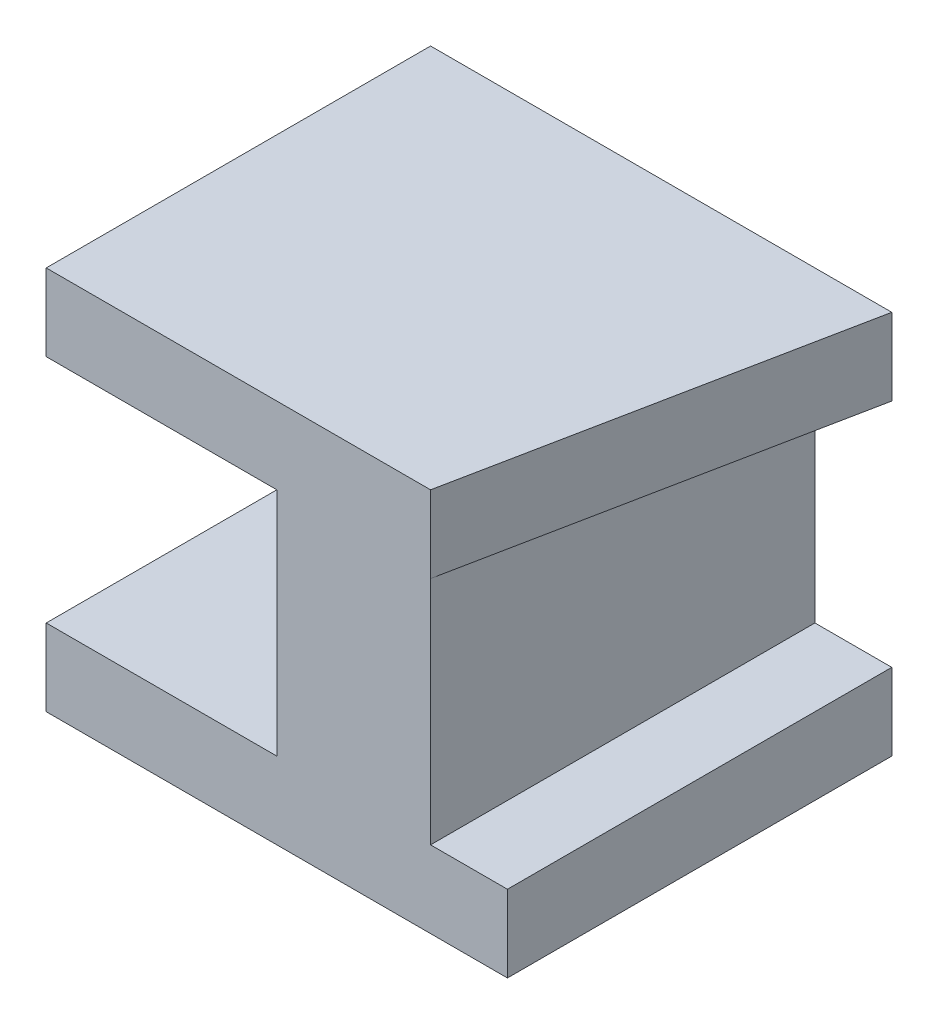
ISO-10303-21;
HEADER;
FILE_DESCRIPTION(('STEP AP214'),'2;1');
FILE_NAME('part.step','',(''),(''),'','','');
FILE_SCHEMA(('AUTOMOTIVE_DESIGN { 1 0 10303 214 1 1 1 1 }'));
ENDSEC;
DATA;
#1=APPLICATION_CONTEXT('core data for automotive mechanical design processes');
#2=APPLICATION_PROTOCOL_DEFINITION('international standard','automotive_design',2000,#1);
#3=PRODUCT_CONTEXT('',#1,'mechanical');
#4=PRODUCT('Part','Part','',(#3));
#5=PRODUCT_RELATED_PRODUCT_CATEGORY('part','',(#4));
#6=PRODUCT_DEFINITION_FORMATION('','',#4);
#7=PRODUCT_DEFINITION_CONTEXT('part definition',#1,'design');
#8=PRODUCT_DEFINITION('design','',#6,#7);
#9=PRODUCT_DEFINITION_SHAPE('','',#8);
#10=(LENGTH_UNIT() NAMED_UNIT(*) SI_UNIT(.MILLI.,.METRE.));
#11=(NAMED_UNIT(*) PLANE_ANGLE_UNIT() SI_UNIT($,.RADIAN.));
#12=(NAMED_UNIT(*) SI_UNIT($,.STERADIAN.) SOLID_ANGLE_UNIT());
#13=UNCERTAINTY_MEASURE_WITH_UNIT(LENGTH_MEASURE(1.E-05),#10,'distance_accuracy_value','');
#14=(GEOMETRIC_REPRESENTATION_CONTEXT(3) GLOBAL_UNCERTAINTY_ASSIGNED_CONTEXT((#13)) GLOBAL_UNIT_ASSIGNED_CONTEXT((#10,
#11,#12)) REPRESENTATION_CONTEXT('',''));
#15=CARTESIAN_POINT('',(0.,0.,0.));
#16=DIRECTION('',(0.,0.,1.));
#17=DIRECTION('',(1.,0.,0.));
#18=AXIS2_PLACEMENT_3D('',#15,#16,#17);
#19=CARTESIAN_POINT('',(25.,0.,25.));
#20=DIRECTION('',(-1.,0.,0.));
#21=DIRECTION('',(0.,0.,1.));
#22=AXIS2_PLACEMENT_3D('',#19,#20,#21);
#23=PLANE('',#22);
#24=DIRECTION('',(0.,0.,1.));
#25=VECTOR('',#24,1.);
#26=CARTESIAN_POINT('',(25.,5.,25.));
#27=LINE('',#26,#25);
#28=CARTESIAN_POINT('',(25.,5.,0.));
#29=VERTEX_POINT('',#28);
#30=CARTESIAN_POINT('',(25.,5.,25.));
#31=VERTEX_POINT('',#30);
#32=EDGE_CURVE('E141',#29,#31,#27,.T.);
#33=ORIENTED_EDGE('',*,*,#32,.F.);
#34=DIRECTION('',(0.,1.,0.));
#35=VECTOR('',#34,1.);
#36=CARTESIAN_POINT('',(25.,0.,0.));
#37=LINE('',#36,#35);
#38=CARTESIAN_POINT('',(25.,20.,0.));
#39=VERTEX_POINT('',#38);
#40=EDGE_CURVE('E159',#29,#39,#37,.T.);
#41=ORIENTED_EDGE('',*,*,#40,.T.);
#42=DIRECTION('',(0.,0.,-1.));
#43=VECTOR('',#42,1.);
#44=CARTESIAN_POINT('',(25.,20.,25.));
#45=LINE('',#44,#43);
#46=CARTESIAN_POINT('',(25.,20.,25.));
#47=VERTEX_POINT('',#46);
#48=EDGE_CURVE('E146',#47,#39,#45,.T.);
#49=ORIENTED_EDGE('',*,*,#48,.F.);
#50=DIRECTION('',(0.,1.,0.));
#51=VECTOR('',#50,1.);
#52=CARTESIAN_POINT('',(25.,0.,25.));
#53=LINE('',#52,#51);
#54=EDGE_CURVE('E48',#31,#47,#53,.T.);
#55=ORIENTED_EDGE('',*,*,#54,.F.);
#56=EDGE_LOOP('',(#33,#41,#49,#55));
#57=FACE_BOUND('',#56,.T.);
#58=ADVANCED_FACE('F33',(#57),#23,.F.);
#59=CARTESIAN_POINT('',(0.,20.,25.));
#60=DIRECTION('',(0.,1.,0.));
#61=DIRECTION('',(0.,0.,1.));
#62=AXIS2_PLACEMENT_3D('',#59,#60,#61);
#63=PLANE('',#62);
#64=DIRECTION('',(1.,0.,0.));
#65=VECTOR('',#64,1.);
#66=CARTESIAN_POINT('',(5.,20.,10.));
#67=LINE('',#66,#65);
#68=CARTESIAN_POINT('',(5.,20.,10.));
#69=VERTEX_POINT('',#68);
#70=CARTESIAN_POINT('',(15.,20.,10.));
#71=VERTEX_POINT('',#70);
#72=EDGE_CURVE('E178',#69,#71,#67,.T.);
#73=ORIENTED_EDGE('',*,*,#72,.T.);
#74=DIRECTION('',(0.,0.,-1.));
#75=VECTOR('',#74,1.);
#76=CARTESIAN_POINT('',(15.,20.,25.));
#77=LINE('',#76,#75);
#78=CARTESIAN_POINT('',(15.,20.,25.));
#79=VERTEX_POINT('',#78);
#80=EDGE_CURVE('E218',#79,#71,#77,.T.);
#81=ORIENTED_EDGE('',*,*,#80,.F.);
#82=DIRECTION('',(1.,0.,0.));
#83=VECTOR('',#82,1.);
#84=CARTESIAN_POINT('',(0.,20.,25.));
#85=LINE('',#84,#83);
#86=CARTESIAN_POINT('',(0.,20.,25.));
#87=VERTEX_POINT('',#86);
#88=EDGE_CURVE('E194',#87,#79,#85,.T.);
#89=ORIENTED_EDGE('',*,*,#88,.F.);
#90=DIRECTION('',(0.,0.,-1.));
#91=VECTOR('',#90,1.);
#92=CARTESIAN_POINT('',(0.,20.,25.));
#93=LINE('',#92,#91);
#94=CARTESIAN_POINT('',(0.,20.,0.));
#95=VERTEX_POINT('',#94);
#96=EDGE_CURVE('E221',#87,#95,#93,.T.);
#97=ORIENTED_EDGE('',*,*,#96,.T.);
#98=DIRECTION('',(1.,0.,0.));
#99=VECTOR('',#98,1.);
#100=CARTESIAN_POINT('',(0.,20.,0.));
#101=LINE('',#100,#99);
#102=CARTESIAN_POINT('',(5.,20.,0.));
#103=VERTEX_POINT('',#102);
#104=EDGE_CURVE('E210',#95,#103,#101,.T.);
#105=ORIENTED_EDGE('',*,*,#104,.T.);
#106=DIRECTION('',(0.,0.,-1.));
#107=VECTOR('',#106,1.);
#108=CARTESIAN_POINT('',(5.,20.,0.));
#109=LINE('',#108,#107);
#110=EDGE_CURVE('E56',#69,#103,#109,.T.);
#111=ORIENTED_EDGE('',*,*,#110,.F.);
#112=EDGE_LOOP('',(#73,#81,#89,#97,#105,#111));
#113=FACE_BOUND('',#112,.T.);
#114=ADVANCED_FACE('F237',(#113),#63,.F.);
#115=CARTESIAN_POINT('',(15.,20.,25.));
#116=DIRECTION('',(1.,0.,0.));
#117=DIRECTION('',(0.,0.,-1.));
#118=AXIS2_PLACEMENT_3D('',#115,#116,#117);
#119=PLANE('',#118);
#120=DIRECTION('',(0.,1.,0.));
#121=VECTOR('',#120,1.);
#122=CARTESIAN_POINT('',(15.,5.,10.));
#123=LINE('',#122,#121);
#124=CARTESIAN_POINT('',(15.,5.,10.));
#125=VERTEX_POINT('',#124);
#126=EDGE_CURVE('E168',#125,#71,#123,.T.);
#127=ORIENTED_EDGE('',*,*,#126,.F.);
#128=DIRECTION('',(0.,0.,-1.));
#129=VECTOR('',#128,1.);
#130=CARTESIAN_POINT('',(15.,5.,25.));
#131=LINE('',#130,#129);
#132=CARTESIAN_POINT('',(15.,5.,25.));
#133=VERTEX_POINT('',#132);
#134=EDGE_CURVE('E215',#133,#125,#131,.T.);
#135=ORIENTED_EDGE('',*,*,#134,.F.);
#136=DIRECTION('',(0.,-1.,0.));
#137=VECTOR('',#136,1.);
#138=CARTESIAN_POINT('',(15.,20.,25.));
#139=LINE('',#138,#137);
#140=EDGE_CURVE('E196',#79,#133,#139,.T.);
#141=ORIENTED_EDGE('',*,*,#140,.F.);
#142=ORIENTED_EDGE('',*,*,#80,.T.);
#143=EDGE_LOOP('',(#127,#135,#141,#142));
#144=FACE_BOUND('',#143,.T.);
#145=ADVANCED_FACE('F248',(#144),#119,.F.);
#146=CARTESIAN_POINT('',(15.,5.,25.));
#147=DIRECTION('',(0.,-1.,0.));
#148=DIRECTION('',(1.,0.,0.));
#149=AXIS2_PLACEMENT_3D('',#146,#147,#148);
#150=PLANE('',#149);
#151=DIRECTION('',(1.,0.,0.));
#152=VECTOR('',#151,1.);
#153=CARTESIAN_POINT('',(5.,5.,10.));
#154=LINE('',#153,#152);
#155=CARTESIAN_POINT('',(5.,5.,10.));
#156=VERTEX_POINT('',#155);
#157=EDGE_CURVE('E182',#156,#125,#154,.T.);
#158=ORIENTED_EDGE('',*,*,#157,.F.);
#159=DIRECTION('',(0.,0.,1.));
#160=VECTOR('',#159,1.);
#161=CARTESIAN_POINT('',(5.,5.,0.));
#162=LINE('',#161,#160);
#163=CARTESIAN_POINT('',(5.,5.,0.));
#164=VERTEX_POINT('',#163);
#165=EDGE_CURVE('E172',#164,#156,#162,.T.);
#166=ORIENTED_EDGE('',*,*,#165,.F.);
#167=DIRECTION('',(-1.,0.,0.));
#168=VECTOR('',#167,1.);
#169=CARTESIAN_POINT('',(15.,5.,0.));
#170=LINE('',#169,#168);
#171=CARTESIAN_POINT('',(0.,5.,0.));
#172=VERTEX_POINT('',#171);
#173=EDGE_CURVE('E189',#164,#172,#170,.T.);
#174=ORIENTED_EDGE('',*,*,#173,.T.);
#175=DIRECTION('',(0.,0.,-1.));
#176=VECTOR('',#175,1.);
#177=CARTESIAN_POINT('',(0.,5.,25.));
#178=LINE('',#177,#176);
#179=CARTESIAN_POINT('',(0.,5.,25.));
#180=VERTEX_POINT('',#179);
#181=EDGE_CURVE('E200',#180,#172,#178,.T.);
#182=ORIENTED_EDGE('',*,*,#181,.F.);
#183=DIRECTION('',(-1.,0.,0.));
#184=VECTOR('',#183,1.);
#185=CARTESIAN_POINT('',(15.,5.,25.));
#186=LINE('',#185,#184);
#187=EDGE_CURVE('E198',#133,#180,#186,.T.);
#188=ORIENTED_EDGE('',*,*,#187,.F.);
#189=ORIENTED_EDGE('',*,*,#134,.T.);
#190=EDGE_LOOP('',(#158,#166,#174,#182,#188,#189));
#191=FACE_BOUND('',#190,.T.);
#192=ADVANCED_FACE('F281',(#191),#150,.F.);
#193=CARTESIAN_POINT('',(0.,5.,25.));
#194=DIRECTION('',(1.,0.,0.));
#195=DIRECTION('',(0.,1.,0.));
#196=AXIS2_PLACEMENT_3D('',#193,#194,#195);
#197=PLANE('',#196);
#198=DIRECTION('',(0.,-1.,0.));
#199=VECTOR('',#198,1.);
#200=CARTESIAN_POINT('',(0.,5.,0.));
#201=LINE('',#200,#199);
#202=CARTESIAN_POINT('',(0.,0.,0.));
#203=VERTEX_POINT('',#202);
#204=EDGE_CURVE('E185',#172,#203,#201,.T.);
#205=ORIENTED_EDGE('',*,*,#204,.T.);
#206=DIRECTION('',(0.,0.,-1.));
#207=VECTOR('',#206,1.);
#208=CARTESIAN_POINT('',(0.,0.,25.));
#209=LINE('',#208,#207);
#210=CARTESIAN_POINT('',(0.,0.,25.));
#211=VERTEX_POINT('',#210);
#212=EDGE_CURVE('E11',#211,#203,#209,.T.);
#213=ORIENTED_EDGE('',*,*,#212,.F.);
#214=DIRECTION('',(0.,-1.,0.));
#215=VECTOR('',#214,1.);
#216=CARTESIAN_POINT('',(0.,5.,25.));
#217=LINE('',#216,#215);
#218=EDGE_CURVE('E186',#180,#211,#217,.T.);
#219=ORIENTED_EDGE('',*,*,#218,.F.);
#220=ORIENTED_EDGE('',*,*,#181,.T.);
#221=EDGE_LOOP('',(#205,#213,#219,#220));
#222=FACE_BOUND('',#221,.T.);
#223=ADVANCED_FACE('F35',(#222),#197,.F.);
#224=CARTESIAN_POINT('',(0.,0.,25.));
#225=DIRECTION('',(0.,1.,0.));
#226=DIRECTION('',(0.,0.,1.));
#227=AXIS2_PLACEMENT_3D('',#224,#225,#226);
#228=PLANE('',#227);
#229=DIRECTION('',(1.,0.,0.));
#230=VECTOR('',#229,1.);
#231=CARTESIAN_POINT('',(0.,0.,0.));
#232=LINE('',#231,#230);
#233=CARTESIAN_POINT('',(30.,0.,0.));
#234=VERTEX_POINT('',#233);
#235=EDGE_CURVE('E203',#203,#234,#232,.T.);
#236=ORIENTED_EDGE('',*,*,#235,.T.);
#237=DIRECTION('',(0.,0.,-1.));
#238=VECTOR('',#237,1.);
#239=CARTESIAN_POINT('',(30.,0.,25.));
#240=LINE('',#239,#238);
#241=CARTESIAN_POINT('',(30.,0.,25.));
#242=VERTEX_POINT('',#241);
#243=EDGE_CURVE('E258',#242,#234,#240,.T.);
#244=ORIENTED_EDGE('',*,*,#243,.F.);
#245=DIRECTION('',(1.,0.,0.));
#246=VECTOR('',#245,1.);
#247=CARTESIAN_POINT('',(0.,0.,25.));
#248=LINE('',#247,#246);
#249=EDGE_CURVE('E157',#211,#242,#248,.T.);
#250=ORIENTED_EDGE('',*,*,#249,.F.);
#251=ORIENTED_EDGE('',*,*,#212,.T.);
#252=EDGE_LOOP('',(#236,#244,#250,#251));
#253=FACE_BOUND('',#252,.T.);
#254=ADVANCED_FACE('F276',(#253),#228,.F.);
#255=CARTESIAN_POINT('',(25.,25.,25.));
#256=DIRECTION('',(0.,-1.,0.));
#257=DIRECTION('',(1.,0.,0.));
#258=AXIS2_PLACEMENT_3D('',#255,#256,#257);
#259=PLANE('',#258);
#260=DIRECTION('',(-1.,0.,0.));
#261=VECTOR('',#260,1.);
#262=CARTESIAN_POINT('',(25.,25.,25.));
#263=LINE('',#262,#261);
#264=CARTESIAN_POINT('',(25.,25.,25.));
#265=VERTEX_POINT('',#264);
#266=CARTESIAN_POINT('',(0.,25.,25.));
#267=VERTEX_POINT('',#266);
#268=EDGE_CURVE('E156',#265,#267,#263,.T.);
#269=ORIENTED_EDGE('',*,*,#268,.F.);
#270=DIRECTION('',(-0.196116135138184,0.,0.98058067569092));
#271=VECTOR('',#270,1.);
#272=CARTESIAN_POINT('',(25.,25.,25.));
#273=LINE('',#272,#271);
#274=CARTESIAN_POINT('',(30.,25.,0.));
#275=VERTEX_POINT('',#274);
#276=EDGE_CURVE('E138',#275,#265,#273,.T.);
#277=ORIENTED_EDGE('',*,*,#276,.F.);
#278=DIRECTION('',(-1.,0.,0.));
#279=VECTOR('',#278,1.);
#280=CARTESIAN_POINT('',(25.,25.,0.));
#281=LINE('',#280,#279);
#282=CARTESIAN_POINT('',(0.,25.,0.));
#283=VERTEX_POINT('',#282);
#284=EDGE_CURVE('E206',#275,#283,#281,.T.);
#285=ORIENTED_EDGE('',*,*,#284,.T.);
#286=DIRECTION('',(0.,0.,-1.));
#287=VECTOR('',#286,1.);
#288=CARTESIAN_POINT('',(0.,25.,25.));
#289=LINE('',#288,#287);
#290=EDGE_CURVE('E41',#267,#283,#289,.T.);
#291=ORIENTED_EDGE('',*,*,#290,.F.);
#292=EDGE_LOOP('',(#269,#277,#285,#291));
#293=FACE_BOUND('',#292,.T.);
#294=ADVANCED_FACE('F252',(#293),#259,.F.);
#295=CARTESIAN_POINT('',(0.,25.,25.));
#296=DIRECTION('',(1.,0.,0.));
#297=DIRECTION('',(0.,1.,0.));
#298=AXIS2_PLACEMENT_3D('',#295,#296,#297);
#299=PLANE('',#298);
#300=DIRECTION('',(0.,-1.,0.));
#301=VECTOR('',#300,1.);
#302=CARTESIAN_POINT('',(0.,25.,0.));
#303=LINE('',#302,#301);
#304=EDGE_CURVE('E208',#283,#95,#303,.T.);
#305=ORIENTED_EDGE('',*,*,#304,.T.);
#306=ORIENTED_EDGE('',*,*,#96,.F.);
#307=DIRECTION('',(0.,-1.,0.));
#308=VECTOR('',#307,1.);
#309=CARTESIAN_POINT('',(0.,25.,25.));
#310=LINE('',#309,#308);
#311=EDGE_CURVE('E192',#267,#87,#310,.T.);
#312=ORIENTED_EDGE('',*,*,#311,.F.);
#313=ORIENTED_EDGE('',*,*,#290,.T.);
#314=EDGE_LOOP('',(#305,#306,#312,#313));
#315=FACE_BOUND('',#314,.T.);
#316=ADVANCED_FACE('F228',(#315),#299,.F.);
#317=CARTESIAN_POINT('',(0.,0.,25.));
#318=DIRECTION('',(0.,0.,1.));
#319=DIRECTION('',(1.,0.,0.));
#320=AXIS2_PLACEMENT_3D('',#317,#318,#319);
#321=PLANE('',#320);
#322=DIRECTION('',(0.,1.,0.));
#323=VECTOR('',#322,1.);
#324=CARTESIAN_POINT('',(25.,20.,25.));
#325=LINE('',#324,#323);
#326=EDGE_CURVE('E132',#47,#265,#325,.T.);
#327=ORIENTED_EDGE('',*,*,#326,.T.);
#328=ORIENTED_EDGE('',*,*,#268,.T.);
#329=ORIENTED_EDGE('',*,*,#311,.T.);
#330=ORIENTED_EDGE('',*,*,#88,.T.);
#331=ORIENTED_EDGE('',*,*,#140,.T.);
#332=ORIENTED_EDGE('',*,*,#187,.T.);
#333=ORIENTED_EDGE('',*,*,#218,.T.);
#334=ORIENTED_EDGE('',*,*,#249,.T.);
#335=DIRECTION('',(0.,-1.,0.));
#336=VECTOR('',#335,1.);
#337=CARTESIAN_POINT('',(30.,0.,25.));
#338=LINE('',#337,#336);
#339=CARTESIAN_POINT('',(30.,5.,25.));
#340=VERTEX_POINT('',#339);
#341=EDGE_CURVE('E255',#340,#242,#338,.T.);
#342=ORIENTED_EDGE('',*,*,#341,.F.);
#343=DIRECTION('',(-1.,0.,0.));
#344=VECTOR('',#343,1.);
#345=CARTESIAN_POINT('',(30.,5.,25.));
#346=LINE('',#345,#344);
#347=EDGE_CURVE('E155',#340,#31,#346,.T.);
#348=ORIENTED_EDGE('',*,*,#347,.T.);
#349=ORIENTED_EDGE('',*,*,#54,.T.);
#350=EDGE_LOOP('',(#327,#328,#329,#330,#331,#332,#333,#334,#342,#348,#349));
#351=FACE_BOUND('',#350,.T.);
#352=ADVANCED_FACE('F152',(#351),#321,.T.);
#353=CARTESIAN_POINT('',(0.,0.,0.));
#354=DIRECTION('',(0.,0.,1.));
#355=DIRECTION('',(1.,0.,0.));
#356=AXIS2_PLACEMENT_3D('',#353,#354,#355);
#357=PLANE('',#356);
#358=ORIENTED_EDGE('',*,*,#173,.F.);
#359=DIRECTION('',(0.,-1.,0.));
#360=VECTOR('',#359,1.);
#361=CARTESIAN_POINT('',(5.,5.,0.));
#362=LINE('',#361,#360);
#363=EDGE_CURVE('E169',#103,#164,#362,.T.);
#364=ORIENTED_EDGE('',*,*,#363,.F.);
#365=ORIENTED_EDGE('',*,*,#104,.F.);
#366=ORIENTED_EDGE('',*,*,#304,.F.);
#367=ORIENTED_EDGE('',*,*,#284,.F.);
#368=DIRECTION('',(0.,1.,0.));
#369=VECTOR('',#368,1.);
#370=CARTESIAN_POINT('',(30.,25.,0.));
#371=LINE('',#370,#369);
#372=CARTESIAN_POINT('',(30.,20.,0.));
#373=VERTEX_POINT('',#372);
#374=EDGE_CURVE('E160',#373,#275,#371,.T.);
#375=ORIENTED_EDGE('',*,*,#374,.F.);
#376=DIRECTION('',(-1.,0.,0.));
#377=VECTOR('',#376,1.);
#378=CARTESIAN_POINT('',(30.,20.,0.));
#379=LINE('',#378,#377);
#380=EDGE_CURVE('E148',#373,#39,#379,.T.);
#381=ORIENTED_EDGE('',*,*,#380,.T.);
#382=ORIENTED_EDGE('',*,*,#40,.F.);
#383=DIRECTION('',(-1.,0.,0.));
#384=VECTOR('',#383,1.);
#385=CARTESIAN_POINT('',(30.,5.,0.));
#386=LINE('',#385,#384);
#387=CARTESIAN_POINT('',(30.,5.,0.));
#388=VERTEX_POINT('',#387);
#389=EDGE_CURVE('E161',#388,#29,#386,.T.);
#390=ORIENTED_EDGE('',*,*,#389,.F.);
#391=DIRECTION('',(0.,1.,0.));
#392=VECTOR('',#391,1.);
#393=CARTESIAN_POINT('',(30.,0.,0.));
#394=LINE('',#393,#392);
#395=EDGE_CURVE('E261',#234,#388,#394,.T.);
#396=ORIENTED_EDGE('',*,*,#395,.F.);
#397=ORIENTED_EDGE('',*,*,#235,.F.);
#398=ORIENTED_EDGE('',*,*,#204,.F.);
#399=EDGE_LOOP('',(#358,#364,#365,#366,#367,#375,#381,#382,#390,#396,#397,#398));
#400=FACE_BOUND('',#399,.T.);
#401=ADVANCED_FACE('F235',(#400),#357,.F.);
#402=CARTESIAN_POINT('',(5.,5.,10.));
#403=DIRECTION('',(0.,0.,-1.));
#404=DIRECTION('',(-1.,0.,0.));
#405=AXIS2_PLACEMENT_3D('',#402,#403,#404);
#406=PLANE('',#405);
#407=ORIENTED_EDGE('',*,*,#126,.T.);
#408=ORIENTED_EDGE('',*,*,#72,.F.);
#409=DIRECTION('',(0.,1.,0.));
#410=VECTOR('',#409,1.);
#411=CARTESIAN_POINT('',(5.,5.,10.));
#412=LINE('',#411,#410);
#413=EDGE_CURVE('E175',#156,#69,#412,.T.);
#414=ORIENTED_EDGE('',*,*,#413,.F.);
#415=ORIENTED_EDGE('',*,*,#157,.T.);
#416=EDGE_LOOP('',(#407,#408,#414,#415));
#417=FACE_BOUND('',#416,.T.);
#418=ADVANCED_FACE('F244',(#417),#406,.F.);
#419=CARTESIAN_POINT('',(5.,0.,0.));
#420=DIRECTION('',(1.,0.,0.));
#421=DIRECTION('',(0.,0.,-1.));
#422=AXIS2_PLACEMENT_3D('',#419,#420,#421);
#423=PLANE('',#422);
#424=ORIENTED_EDGE('',*,*,#363,.T.);
#425=ORIENTED_EDGE('',*,*,#165,.T.);
#426=ORIENTED_EDGE('',*,*,#413,.T.);
#427=ORIENTED_EDGE('',*,*,#110,.T.);
#428=EDGE_LOOP('',(#424,#425,#426,#427));
#429=FACE_BOUND('',#428,.T.);
#430=ADVANCED_FACE('F240',(#429),#423,.F.);
#431=CARTESIAN_POINT('',(30.,20.,25.));
#432=DIRECTION('',(0.,1.,0.));
#433=DIRECTION('',(0.,0.,1.));
#434=AXIS2_PLACEMENT_3D('',#431,#432,#433);
#435=PLANE('',#434);
#436=ORIENTED_EDGE('',*,*,#380,.F.);
#437=DIRECTION('',(-0.196116135138184,0.,0.98058067569092));
#438=VECTOR('',#437,1.);
#439=CARTESIAN_POINT('',(25.,20.,25.));
#440=LINE('',#439,#438);
#441=EDGE_CURVE('E135',#373,#47,#440,.T.);
#442=ORIENTED_EDGE('',*,*,#441,.T.);
#443=ORIENTED_EDGE('',*,*,#48,.T.);
#444=EDGE_LOOP('',(#436,#442,#443));
#445=FACE_BOUND('',#444,.T.);
#446=ADVANCED_FACE('F145',(#445),#435,.F.);
#447=CARTESIAN_POINT('',(30.,5.,25.));
#448=DIRECTION('',(0.,-1.,0.));
#449=DIRECTION('',(0.,0.,-1.));
#450=AXIS2_PLACEMENT_3D('',#447,#448,#449);
#451=PLANE('',#450);
#452=ORIENTED_EDGE('',*,*,#32,.T.);
#453=ORIENTED_EDGE('',*,*,#347,.F.);
#454=DIRECTION('',(0.,0.,1.));
#455=VECTOR('',#454,1.);
#456=CARTESIAN_POINT('',(30.,5.,25.));
#457=LINE('',#456,#455);
#458=EDGE_CURVE('E263',#388,#340,#457,.T.);
#459=ORIENTED_EDGE('',*,*,#458,.F.);
#460=ORIENTED_EDGE('',*,*,#389,.T.);
#461=EDGE_LOOP('',(#452,#453,#459,#460));
#462=FACE_BOUND('',#461,.T.);
#463=ADVANCED_FACE('F267',(#462),#451,.F.);
#464=CARTESIAN_POINT('',(30.,0.,0.));
#465=DIRECTION('',(-1.,0.,0.));
#466=DIRECTION('',(0.,0.,1.));
#467=AXIS2_PLACEMENT_3D('',#464,#465,#466);
#468=PLANE('',#467);
#469=ORIENTED_EDGE('',*,*,#341,.T.);
#470=ORIENTED_EDGE('',*,*,#243,.T.);
#471=ORIENTED_EDGE('',*,*,#395,.T.);
#472=ORIENTED_EDGE('',*,*,#458,.T.);
#473=EDGE_LOOP('',(#469,#470,#471,#472));
#474=FACE_BOUND('',#473,.T.);
#475=ADVANCED_FACE('F273',(#474),#468,.F.);
#476=CARTESIAN_POINT('',(25.,20.,25.));
#477=DIRECTION('',(-0.98058067569092,0.,-0.196116135138184));
#478=DIRECTION('',(-0.196116135138184,0.,0.98058067569092));
#479=AXIS2_PLACEMENT_3D('',#476,#477,#478);
#480=PLANE('',#479);
#481=ORIENTED_EDGE('',*,*,#276,.T.);
#482=ORIENTED_EDGE('',*,*,#326,.F.);
#483=ORIENTED_EDGE('',*,*,#441,.F.);
#484=ORIENTED_EDGE('',*,*,#374,.T.);
#485=EDGE_LOOP('',(#481,#482,#483,#484));
#486=FACE_BOUND('',#485,.T.);
#487=ADVANCED_FACE('F134',(#486),#480,.F.);
#488=CLOSED_SHELL('',(#58,#114,#145,#192,#223,#254,#294,#316,#352,#401,#418,#430,#446,#463,#475,#487));
#489=MANIFOLD_SOLID_BREP('B2',#488);
#490=ADVANCED_BREP_SHAPE_REPRESENTATION('',(#18,#489),#14);
#491=SHAPE_DEFINITION_REPRESENTATION(#9,#490);
ENDSEC;
END-ISO-10303-21;
